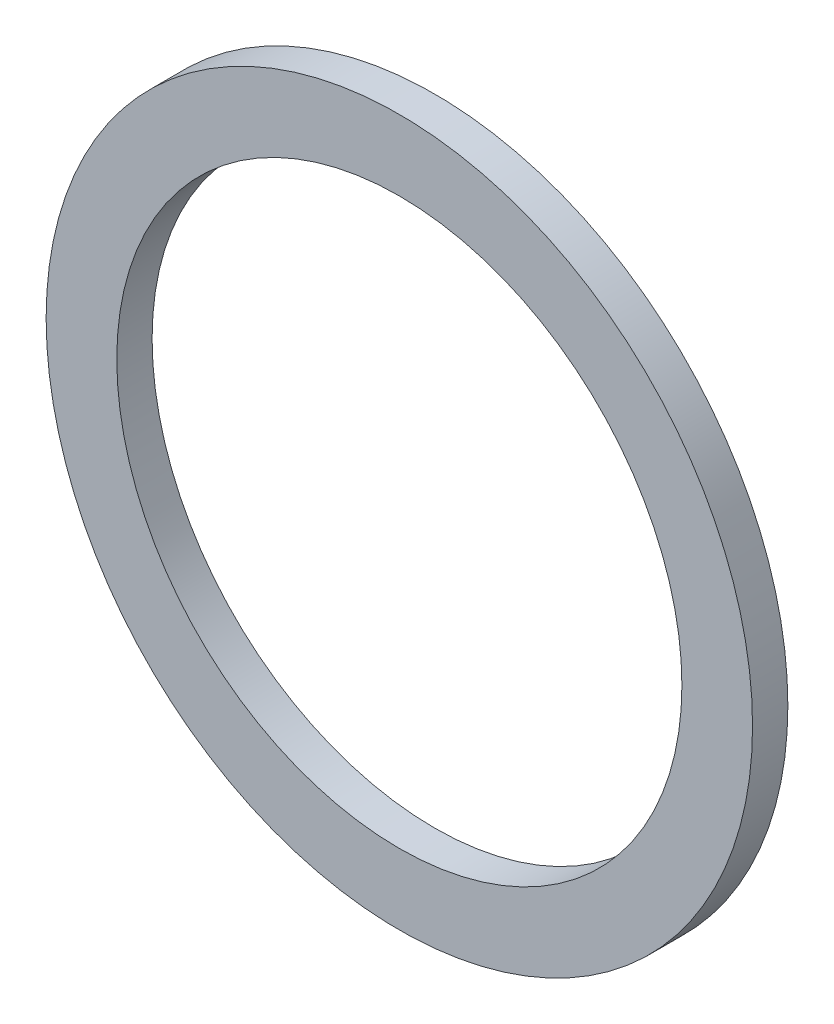
ISO-10303-21;
HEADER;
FILE_DESCRIPTION(('STEP AP214'),'2;1');
FILE_NAME('part.step','',(''),(''),'','','');
FILE_SCHEMA(('AUTOMOTIVE_DESIGN { 1 0 10303 214 1 1 1 1 }'));
ENDSEC;
DATA;
#1=APPLICATION_CONTEXT('core data for automotive mechanical design processes');
#2=APPLICATION_PROTOCOL_DEFINITION('international standard','automotive_design',2000,#1);
#3=PRODUCT_CONTEXT('',#1,'mechanical');
#4=PRODUCT('Part','Part','',(#3));
#5=PRODUCT_RELATED_PRODUCT_CATEGORY('part','',(#4));
#6=PRODUCT_DEFINITION_FORMATION('','',#4);
#7=PRODUCT_DEFINITION_CONTEXT('part definition',#1,'design');
#8=PRODUCT_DEFINITION('design','',#6,#7);
#9=PRODUCT_DEFINITION_SHAPE('','',#8);
#10=(LENGTH_UNIT() NAMED_UNIT(*) SI_UNIT(.MILLI.,.METRE.));
#11=(NAMED_UNIT(*) PLANE_ANGLE_UNIT() SI_UNIT($,.RADIAN.));
#12=(NAMED_UNIT(*) SI_UNIT($,.STERADIAN.) SOLID_ANGLE_UNIT());
#13=UNCERTAINTY_MEASURE_WITH_UNIT(LENGTH_MEASURE(1.E-05),#10,'distance_accuracy_value','');
#14=(GEOMETRIC_REPRESENTATION_CONTEXT(3) GLOBAL_UNCERTAINTY_ASSIGNED_CONTEXT((#13)) GLOBAL_UNIT_ASSIGNED_CONTEXT((#10,
#11,#12)) REPRESENTATION_CONTEXT('',''));
#15=CARTESIAN_POINT('',(0.,0.,0.));
#16=DIRECTION('',(0.,0.,1.));
#17=DIRECTION('',(1.,0.,0.));
#18=AXIS2_PLACEMENT_3D('',#15,#16,#17);
#19=CARTESIAN_POINT('',(-8.00000011920929,-6.66666669646899,2.));
#20=DIRECTION('',(0.,0.,1.));
#21=DIRECTION('',(1.,0.,0.));
#22=AXIS2_PLACEMENT_3D('',#19,#20,#21);
#23=PLANE('',#22);
#24=CARTESIAN_POINT('',(-8.00000011920929,-6.66666669646899,2.));
#25=DIRECTION('',(0.,0.,-1.));
#26=DIRECTION('',(-1.,0.,0.));
#27=AXIS2_PLACEMENT_3D('',#24,#25,#26);
#28=CIRCLE('',#27,0.800000014901161);
#29=CARTESIAN_POINT('',(-7.20000010430813,-6.66666669646899,2.));
#30=VERTEX_POINT('',#29);
#31=EDGE_CURVE('E51',#30,#30,#28,.T.);
#32=ORIENTED_EDGE('',*,*,#31,.F.);
#33=EDGE_LOOP('',(#32));
#34=FACE_BOUND('',#33,.T.);
#35=CARTESIAN_POINT('',(-8.00000011920929,-6.66666669646899,2.));
#36=DIRECTION('',(0.,0.,1.));
#37=DIRECTION('',(-1.,0.,0.));
#38=AXIS2_PLACEMENT_3D('',#35,#36,#37);
#39=CIRCLE('',#38,1.00000001490116);
#40=CARTESIAN_POINT('',(-7.00000010430813,-6.66666669646899,2.));
#41=VERTEX_POINT('',#40);
#42=EDGE_CURVE('E11',#41,#41,#39,.T.);
#43=ORIENTED_EDGE('',*,*,#42,.F.);
#44=EDGE_LOOP('',(#43));
#45=FACE_BOUND('',#44,.T.);
#46=ADVANCED_FACE('F17',(#34,#45),#23,.F.);
#47=CARTESIAN_POINT('',(-8.00000011920929,-6.66666669646899,2.1));
#48=DIRECTION('',(0.,0.,1.));
#49=DIRECTION('',(1.,0.,0.));
#50=AXIS2_PLACEMENT_3D('',#47,#48,#49);
#51=PLANE('',#50);
#52=CARTESIAN_POINT('',(-8.00000011920929,-6.66666669646899,2.1));
#53=DIRECTION('',(0.,0.,-1.));
#54=DIRECTION('',(-1.,0.,0.));
#55=AXIS2_PLACEMENT_3D('',#52,#53,#54);
#56=CIRCLE('',#55,0.800000014901161);
#57=CARTESIAN_POINT('',(-7.20000010430813,-6.66666669646899,2.1));
#58=VERTEX_POINT('',#57);
#59=EDGE_CURVE('E21',#58,#58,#56,.T.);
#60=ORIENTED_EDGE('',*,*,#59,.T.);
#61=EDGE_LOOP('',(#60));
#62=FACE_BOUND('',#61,.T.);
#63=CARTESIAN_POINT('',(-8.00000011920929,-6.66666669646899,2.1));
#64=DIRECTION('',(0.,0.,1.));
#65=DIRECTION('',(-1.,0.,0.));
#66=AXIS2_PLACEMENT_3D('',#63,#64,#65);
#67=CIRCLE('',#66,1.00000001490116);
#68=CARTESIAN_POINT('',(-7.00000010430813,-6.66666669646899,2.1));
#69=VERTEX_POINT('',#68);
#70=EDGE_CURVE('E58',#69,#69,#67,.T.);
#71=ORIENTED_EDGE('',*,*,#70,.T.);
#72=EDGE_LOOP('',(#71));
#73=FACE_BOUND('',#72,.T.);
#74=ADVANCED_FACE('F71',(#62,#73),#51,.T.);
#75=CARTESIAN_POINT('',(-8.00000011920929,-6.66666669646899,2.));
#76=DIRECTION('',(0.,0.,1.));
#77=DIRECTION('',(-1.,0.,0.));
#78=AXIS2_PLACEMENT_3D('',#75,#76,#77);
#79=CYLINDRICAL_SURFACE('',#78,1.00000001490116);
#80=ORIENTED_EDGE('',*,*,#70,.F.);
#81=DIRECTION('',(0.,0.,-1.));
#82=VECTOR('',#81,1.);
#83=CARTESIAN_POINT('',(-7.00000010430813,-6.66666669646899,2.));
#84=LINE('',#83,#82);
#85=EDGE_CURVE('E28',#69,#41,#84,.T.);
#86=ORIENTED_EDGE('',*,*,#85,.T.);
#87=ORIENTED_EDGE('',*,*,#42,.T.);
#88=ORIENTED_EDGE('',*,*,#85,.F.);
#89=EDGE_LOOP('',(#80,#86,#87,#88));
#90=FACE_BOUND('',#89,.T.);
#91=ADVANCED_FACE('F19',(#90),#79,.T.);
#92=CARTESIAN_POINT('',(-8.00000011920929,-6.66666669646899,2.));
#93=DIRECTION('',(0.,0.,1.));
#94=DIRECTION('',(-1.,0.,0.));
#95=AXIS2_PLACEMENT_3D('',#92,#93,#94);
#96=CYLINDRICAL_SURFACE('',#95,0.800000014901161);
#97=ORIENTED_EDGE('',*,*,#59,.F.);
#98=DIRECTION('',(0.,0.,-1.));
#99=VECTOR('',#98,1.);
#100=CARTESIAN_POINT('',(-7.20000010430813,-6.66666669646899,2.));
#101=LINE('',#100,#99);
#102=EDGE_CURVE('E54',#58,#30,#101,.T.);
#103=ORIENTED_EDGE('',*,*,#102,.T.);
#104=ORIENTED_EDGE('',*,*,#31,.T.);
#105=ORIENTED_EDGE('',*,*,#102,.F.);
#106=EDGE_LOOP('',(#97,#103,#104,#105));
#107=FACE_BOUND('',#106,.T.);
#108=ADVANCED_FACE('F53',(#107),#96,.F.);
#109=CLOSED_SHELL('',(#46,#74,#91,#108));
#110=MANIFOLD_SOLID_BREP('B1',#109);
#111=ADVANCED_BREP_SHAPE_REPRESENTATION('',(#18,#110),#14);
#112=SHAPE_DEFINITION_REPRESENTATION(#9,#111);
ENDSEC;
END-ISO-10303-21;
